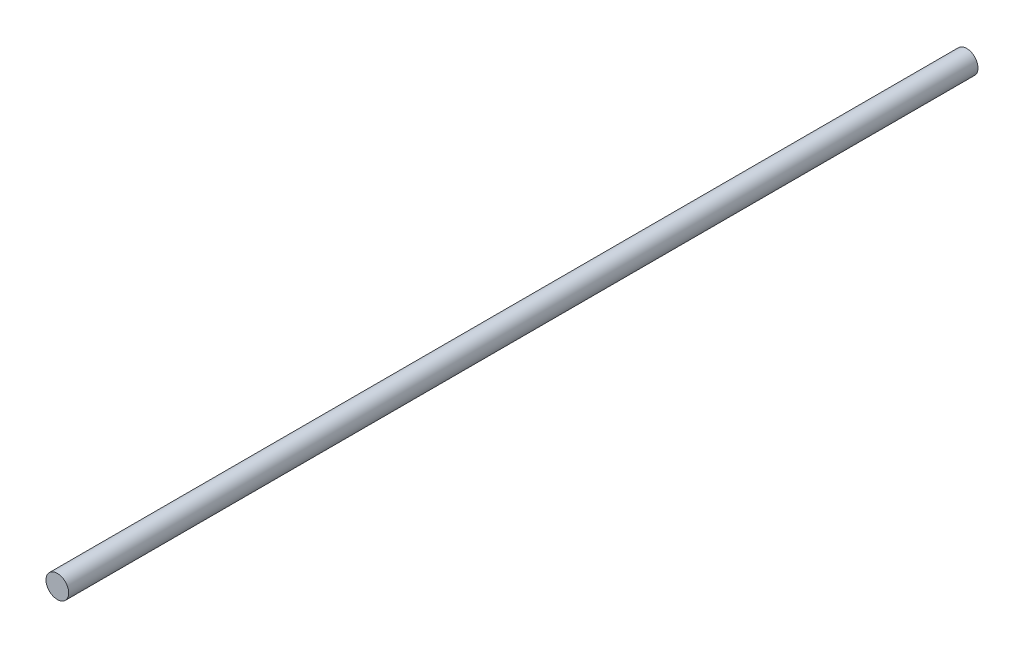
ISO-10303-21;
HEADER;
FILE_DESCRIPTION(('STEP AP214'),'2;1');
FILE_NAME('part.step','',(''),(''),'','','');
FILE_SCHEMA(('AUTOMOTIVE_DESIGN { 1 0 10303 214 1 1 1 1 }'));
ENDSEC;
DATA;
#1=APPLICATION_CONTEXT('core data for automotive mechanical design processes');
#2=APPLICATION_PROTOCOL_DEFINITION('international standard','automotive_design',2000,#1);
#3=PRODUCT_CONTEXT('',#1,'mechanical');
#4=PRODUCT('Part','Part','',(#3));
#5=PRODUCT_RELATED_PRODUCT_CATEGORY('part','',(#4));
#6=PRODUCT_DEFINITION_FORMATION('','',#4);
#7=PRODUCT_DEFINITION_CONTEXT('part definition',#1,'design');
#8=PRODUCT_DEFINITION('design','',#6,#7);
#9=PRODUCT_DEFINITION_SHAPE('','',#8);
#10=(LENGTH_UNIT() NAMED_UNIT(*) SI_UNIT(.MILLI.,.METRE.));
#11=(NAMED_UNIT(*) PLANE_ANGLE_UNIT() SI_UNIT($,.RADIAN.));
#12=(NAMED_UNIT(*) SI_UNIT($,.STERADIAN.) SOLID_ANGLE_UNIT());
#13=UNCERTAINTY_MEASURE_WITH_UNIT(LENGTH_MEASURE(1.E-05),#10,'distance_accuracy_value','');
#14=(GEOMETRIC_REPRESENTATION_CONTEXT(3) GLOBAL_UNCERTAINTY_ASSIGNED_CONTEXT((#13)) GLOBAL_UNIT_ASSIGNED_CONTEXT((#10,
#11,#12)) REPRESENTATION_CONTEXT('',''));
#15=CARTESIAN_POINT('',(0.,0.,0.));
#16=DIRECTION('',(0.,0.,1.));
#17=DIRECTION('',(1.,0.,0.));
#18=AXIS2_PLACEMENT_3D('',#15,#16,#17);
#19=CARTESIAN_POINT('',(0.,0.,240.));
#20=DIRECTION('',(0.,0.,-1.));
#21=DIRECTION('',(-1.,0.,0.));
#22=AXIS2_PLACEMENT_3D('',#19,#20,#21);
#23=CYLINDRICAL_SURFACE('',#22,3.);
#24=CARTESIAN_POINT('',(0.,0.,240.));
#25=DIRECTION('',(0.,0.,1.));
#26=DIRECTION('',(1.,0.,0.));
#27=AXIS2_PLACEMENT_3D('',#24,#25,#26);
#28=CIRCLE('',#27,3.);
#29=CARTESIAN_POINT('',(3.,0.,240.));
#30=VERTEX_POINT('',#29);
#31=EDGE_CURVE('E10',#30,#30,#28,.T.);
#32=ORIENTED_EDGE('',*,*,#31,.F.);
#33=EDGE_LOOP('',(#32));
#34=FACE_BOUND('',#33,.T.);
#35=CARTESIAN_POINT('',(0.,0.,0.));
#36=DIRECTION('',(0.,0.,1.));
#37=DIRECTION('',(1.,0.,0.));
#38=AXIS2_PLACEMENT_3D('',#35,#36,#37);
#39=CIRCLE('',#38,3.);
#40=CARTESIAN_POINT('',(3.,0.,0.));
#41=VERTEX_POINT('',#40);
#42=EDGE_CURVE('E44',#41,#41,#39,.T.);
#43=ORIENTED_EDGE('',*,*,#42,.T.);
#44=EDGE_LOOP('',(#43));
#45=FACE_BOUND('',#44,.T.);
#46=ADVANCED_FACE('F41',(#34,#45),#23,.T.);
#47=CARTESIAN_POINT('',(0.,0.,240.));
#48=DIRECTION('',(0.,0.,1.));
#49=DIRECTION('',(1.,0.,0.));
#50=AXIS2_PLACEMENT_3D('',#47,#48,#49);
#51=PLANE('',#50);
#52=ORIENTED_EDGE('',*,*,#31,.T.);
#53=EDGE_LOOP('',(#52));
#54=FACE_BOUND('',#53,.T.);
#55=ADVANCED_FACE('F58',(#54),#51,.T.);
#56=CARTESIAN_POINT('',(0.,0.,0.));
#57=DIRECTION('',(0.,0.,1.));
#58=DIRECTION('',(1.,0.,0.));
#59=AXIS2_PLACEMENT_3D('',#56,#57,#58);
#60=PLANE('',#59);
#61=ORIENTED_EDGE('',*,*,#42,.F.);
#62=EDGE_LOOP('',(#61));
#63=FACE_BOUND('',#62,.T.);
#64=ADVANCED_FACE('F56',(#63),#60,.F.);
#65=CLOSED_SHELL('',(#46,#55,#64));
#66=MANIFOLD_SOLID_BREP('B2',#65);
#67=ADVANCED_BREP_SHAPE_REPRESENTATION('',(#18,#66),#14);
#68=SHAPE_DEFINITION_REPRESENTATION(#9,#67);
ENDSEC;
END-ISO-10303-21;
